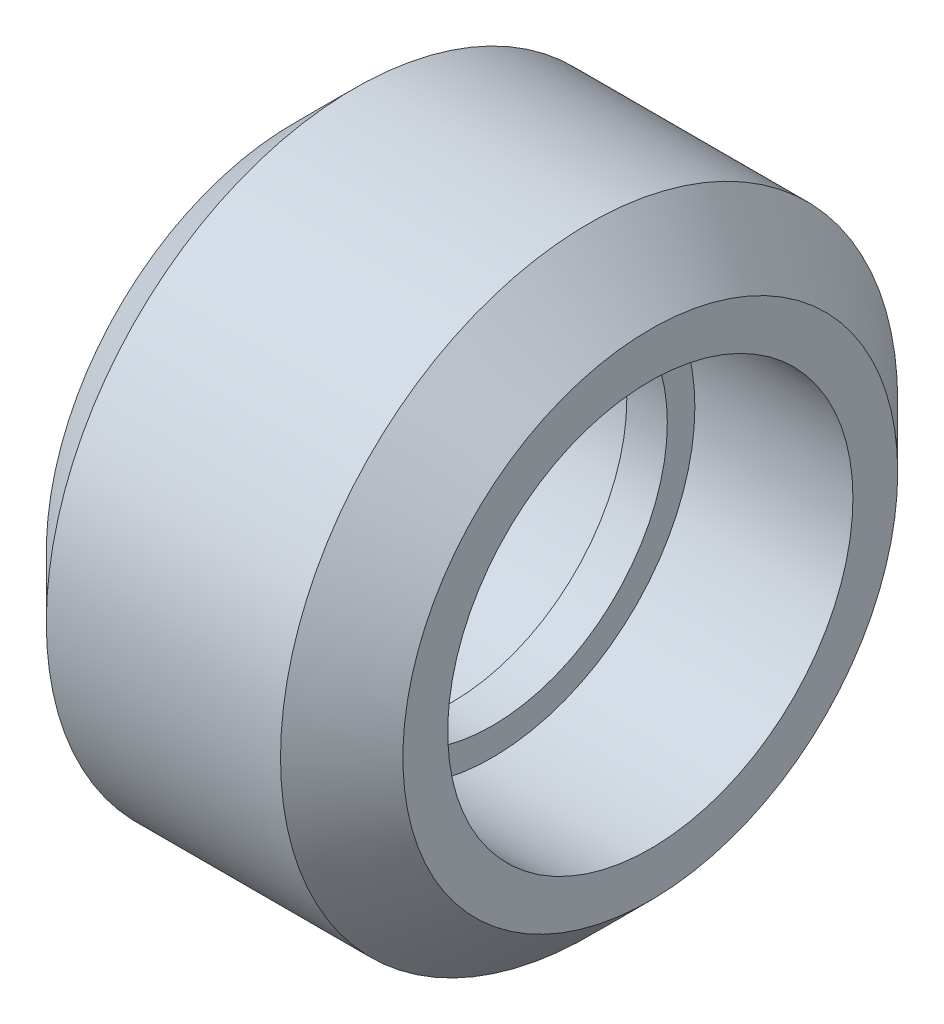
ISO-10303-21;
HEADER;
FILE_DESCRIPTION(('STEP AP214'),'2;1');
FILE_NAME('part.step','',(''),(''),'','','');
FILE_SCHEMA(('AUTOMOTIVE_DESIGN { 1 0 10303 214 1 1 1 1 }'));
ENDSEC;
DATA;
#1=APPLICATION_CONTEXT('core data for automotive mechanical design processes');
#2=APPLICATION_PROTOCOL_DEFINITION('international standard','automotive_design',2000,#1);
#3=PRODUCT_CONTEXT('',#1,'mechanical');
#4=PRODUCT('Part','Part','',(#3));
#5=PRODUCT_RELATED_PRODUCT_CATEGORY('part','',(#4));
#6=PRODUCT_DEFINITION_FORMATION('','',#4);
#7=PRODUCT_DEFINITION_CONTEXT('part definition',#1,'design');
#8=PRODUCT_DEFINITION('design','',#6,#7);
#9=PRODUCT_DEFINITION_SHAPE('','',#8);
#10=(LENGTH_UNIT() NAMED_UNIT(*) SI_UNIT(.MILLI.,.METRE.));
#11=(NAMED_UNIT(*) PLANE_ANGLE_UNIT() SI_UNIT($,.RADIAN.));
#12=(NAMED_UNIT(*) SI_UNIT($,.STERADIAN.) SOLID_ANGLE_UNIT());
#13=UNCERTAINTY_MEASURE_WITH_UNIT(LENGTH_MEASURE(1.E-05),#10,'distance_accuracy_value','');
#14=(GEOMETRIC_REPRESENTATION_CONTEXT(3) GLOBAL_UNCERTAINTY_ASSIGNED_CONTEXT((#13)) GLOBAL_UNIT_ASSIGNED_CONTEXT((#10,
#11,#12)) REPRESENTATION_CONTEXT('',''));
#15=CARTESIAN_POINT('',(0.,0.,0.));
#16=DIRECTION('',(0.,0.,1.));
#17=DIRECTION('',(1.,0.,0.));
#18=AXIS2_PLACEMENT_3D('',#15,#16,#17);
#19=CARTESIAN_POINT('',(-0.5,4.32,0.));
#20=DIRECTION('',(-1.,0.,0.));
#21=DIRECTION('',(0.,0.,1.));
#22=AXIS2_PLACEMENT_3D('',#19,#20,#21);
#23=PLANE('',#22);
#24=CARTESIAN_POINT('',(-0.5,0.,0.));
#25=DIRECTION('',(1.,0.,0.));
#26=DIRECTION('',(0.,0.,-1.));
#27=AXIS2_PLACEMENT_3D('',#24,#25,#26);
#28=CIRCLE('',#27,4.32);
#29=CARTESIAN_POINT('',(-0.5,0.,-4.32));
#30=VERTEX_POINT('',#29);
#31=EDGE_CURVE('E10',#30,#30,#28,.T.);
#32=ORIENTED_EDGE('',*,*,#31,.T.);
#33=EDGE_LOOP('',(#32));
#34=FACE_BOUND('',#33,.T.);
#35=CARTESIAN_POINT('',(-0.5,0.,0.));
#36=DIRECTION('',(1.,0.,0.));
#37=DIRECTION('',(0.,0.,-1.));
#38=AXIS2_PLACEMENT_3D('',#35,#36,#37);
#39=CIRCLE('',#38,5.);
#40=CARTESIAN_POINT('',(-0.5,0.,-5.));
#41=VERTEX_POINT('',#40);
#42=EDGE_CURVE('E73',#41,#41,#39,.T.);
#43=ORIENTED_EDGE('',*,*,#42,.F.);
#44=EDGE_LOOP('',(#43));
#45=FACE_BOUND('',#44,.T.);
#46=ADVANCED_FACE('F39',(#34,#45),#23,.T.);
#47=CARTESIAN_POINT('',(0.,0.,0.));
#48=DIRECTION('',(1.,0.,0.));
#49=DIRECTION('',(0.,0.,-1.));
#50=AXIS2_PLACEMENT_3D('',#47,#48,#49);
#51=CYLINDRICAL_SURFACE('',#50,4.32);
#52=CARTESIAN_POINT('',(0.5,0.,0.));
#53=DIRECTION('',(1.,0.,0.));
#54=DIRECTION('',(0.,0.,-1.));
#55=AXIS2_PLACEMENT_3D('',#52,#53,#54);
#56=CIRCLE('',#55,4.32);
#57=CARTESIAN_POINT('',(0.5,0.,-4.32));
#58=VERTEX_POINT('',#57);
#59=EDGE_CURVE('E45',#58,#58,#56,.T.);
#60=ORIENTED_EDGE('',*,*,#59,.T.);
#61=EDGE_LOOP('',(#60));
#62=FACE_BOUND('',#61,.T.);
#63=ORIENTED_EDGE('',*,*,#31,.F.);
#64=EDGE_LOOP('',(#63));
#65=FACE_BOUND('',#64,.T.);
#66=ADVANCED_FACE('F81',(#62,#65),#51,.F.);
#67=CARTESIAN_POINT('',(0.5,4.32,0.));
#68=DIRECTION('',(1.,0.,0.));
#69=DIRECTION('',(0.,0.,-1.));
#70=AXIS2_PLACEMENT_3D('',#67,#68,#69);
#71=PLANE('',#70);
#72=CARTESIAN_POINT('',(0.5,0.,0.));
#73=DIRECTION('',(1.,0.,0.));
#74=DIRECTION('',(0.,0.,-1.));
#75=AXIS2_PLACEMENT_3D('',#72,#73,#74);
#76=CIRCLE('',#75,5.);
#77=CARTESIAN_POINT('',(0.5,0.,-5.));
#78=VERTEX_POINT('',#77);
#79=EDGE_CURVE('E49',#78,#78,#76,.T.);
#80=ORIENTED_EDGE('',*,*,#79,.T.);
#81=EDGE_LOOP('',(#80));
#82=FACE_BOUND('',#81,.T.);
#83=ORIENTED_EDGE('',*,*,#59,.F.);
#84=EDGE_LOOP('',(#83));
#85=FACE_BOUND('',#84,.T.);
#86=ADVANCED_FACE('F85',(#82,#85),#71,.T.);
#87=CARTESIAN_POINT('',(0.,0.,0.));
#88=DIRECTION('',(1.,0.,0.));
#89=DIRECTION('',(0.,0.,-1.));
#90=AXIS2_PLACEMENT_3D('',#87,#88,#89);
#91=CYLINDRICAL_SURFACE('',#90,5.);
#92=CARTESIAN_POINT('',(4.4,0.,0.));
#93=DIRECTION('',(1.,0.,0.));
#94=DIRECTION('',(0.,0.,-1.));
#95=AXIS2_PLACEMENT_3D('',#92,#93,#94);
#96=CIRCLE('',#95,5.);
#97=CARTESIAN_POINT('',(4.4,0.,-5.));
#98=VERTEX_POINT('',#97);
#99=EDGE_CURVE('E53',#98,#98,#96,.T.);
#100=ORIENTED_EDGE('',*,*,#99,.T.);
#101=EDGE_LOOP('',(#100));
#102=FACE_BOUND('',#101,.T.);
#103=ORIENTED_EDGE('',*,*,#79,.F.);
#104=EDGE_LOOP('',(#103));
#105=FACE_BOUND('',#104,.T.);
#106=ADVANCED_FACE('F89',(#102,#105),#91,.F.);
#107=CARTESIAN_POINT('',(4.4,5.,0.));
#108=DIRECTION('',(1.,0.,0.));
#109=DIRECTION('',(0.,0.,-1.));
#110=AXIS2_PLACEMENT_3D('',#107,#108,#109);
#111=PLANE('',#110);
#112=CARTESIAN_POINT('',(4.4,0.,0.));
#113=DIRECTION('',(1.,0.,0.));
#114=DIRECTION('',(0.,0.,-1.));
#115=AXIS2_PLACEMENT_3D('',#112,#113,#114);
#116=CIRCLE('',#115,6.10500000000001);
#117=CARTESIAN_POINT('',(4.4,0.,-6.10500000000001));
#118=VERTEX_POINT('',#117);
#119=EDGE_CURVE('E58',#118,#118,#116,.T.);
#120=ORIENTED_EDGE('',*,*,#119,.T.);
#121=EDGE_LOOP('',(#120));
#122=FACE_BOUND('',#121,.T.);
#123=ORIENTED_EDGE('',*,*,#99,.F.);
#124=EDGE_LOOP('',(#123));
#125=FACE_BOUND('',#124,.T.);
#126=ADVANCED_FACE('F96',(#122,#125),#111,.T.);
#127=CARTESIAN_POINT('',(4.4,0.,0.));
#128=DIRECTION('',(-1.,0.,0.));
#129=DIRECTION('',(0.,0.,1.));
#130=AXIS2_PLACEMENT_3D('',#127,#128,#129);
#131=CONICAL_SURFACE('',#130,6.10500000000001,0.785398163397447);
#132=CARTESIAN_POINT('',(2.89,0.,0.));
#133=DIRECTION('',(1.,0.,0.));
#134=DIRECTION('',(0.,0.,-1.));
#135=AXIS2_PLACEMENT_3D('',#132,#133,#134);
#136=CIRCLE('',#135,7.615);
#137=CARTESIAN_POINT('',(2.89,0.,-7.615));
#138=VERTEX_POINT('',#137);
#139=EDGE_CURVE('E61',#138,#138,#136,.T.);
#140=ORIENTED_EDGE('',*,*,#139,.T.);
#141=EDGE_LOOP('',(#140));
#142=FACE_BOUND('',#141,.T.);
#143=ORIENTED_EDGE('',*,*,#119,.F.);
#144=EDGE_LOOP('',(#143));
#145=FACE_BOUND('',#144,.T.);
#146=ADVANCED_FACE('F100',(#142,#145),#131,.T.);
#147=CARTESIAN_POINT('',(0.,0.,0.));
#148=DIRECTION('',(1.,0.,0.));
#149=DIRECTION('',(0.,0.,-1.));
#150=AXIS2_PLACEMENT_3D('',#147,#148,#149);
#151=CYLINDRICAL_SURFACE('',#150,7.615);
#152=CARTESIAN_POINT('',(-2.89,0.,0.));
#153=DIRECTION('',(1.,0.,0.));
#154=DIRECTION('',(0.,0.,-1.));
#155=AXIS2_PLACEMENT_3D('',#152,#153,#154);
#156=CIRCLE('',#155,7.615);
#157=CARTESIAN_POINT('',(-2.89,0.,-7.615));
#158=VERTEX_POINT('',#157);
#159=EDGE_CURVE('E64',#158,#158,#156,.T.);
#160=ORIENTED_EDGE('',*,*,#159,.T.);
#161=EDGE_LOOP('',(#160));
#162=FACE_BOUND('',#161,.T.);
#163=ORIENTED_EDGE('',*,*,#139,.F.);
#164=EDGE_LOOP('',(#163));
#165=FACE_BOUND('',#164,.T.);
#166=ADVANCED_FACE('F104',(#162,#165),#151,.T.);
#167=CARTESIAN_POINT('',(-2.89,0.,0.));
#168=DIRECTION('',(1.,0.,0.));
#169=DIRECTION('',(0.,0.,-1.));
#170=AXIS2_PLACEMENT_3D('',#167,#168,#169);
#171=CONICAL_SURFACE('',#170,7.615,0.785398163397447);
#172=CARTESIAN_POINT('',(-4.4,0.,0.));
#173=DIRECTION('',(1.,0.,0.));
#174=DIRECTION('',(0.,0.,-1.));
#175=AXIS2_PLACEMENT_3D('',#172,#173,#174);
#176=CIRCLE('',#175,6.105);
#177=CARTESIAN_POINT('',(-4.4,0.,-6.105));
#178=VERTEX_POINT('',#177);
#179=EDGE_CURVE('E67',#178,#178,#176,.T.);
#180=ORIENTED_EDGE('',*,*,#179,.T.);
#181=EDGE_LOOP('',(#180));
#182=FACE_BOUND('',#181,.T.);
#183=ORIENTED_EDGE('',*,*,#159,.F.);
#184=EDGE_LOOP('',(#183));
#185=FACE_BOUND('',#184,.T.);
#186=ADVANCED_FACE('F108',(#182,#185),#171,.T.);
#187=CARTESIAN_POINT('',(-4.4,5.,0.));
#188=DIRECTION('',(-1.,0.,0.));
#189=DIRECTION('',(0.,0.,1.));
#190=AXIS2_PLACEMENT_3D('',#187,#188,#189);
#191=PLANE('',#190);
#192=CARTESIAN_POINT('',(-4.4,0.,0.));
#193=DIRECTION('',(1.,0.,0.));
#194=DIRECTION('',(0.,0.,-1.));
#195=AXIS2_PLACEMENT_3D('',#192,#193,#194);
#196=CIRCLE('',#195,5.);
#197=CARTESIAN_POINT('',(-4.4,0.,-5.));
#198=VERTEX_POINT('',#197);
#199=EDGE_CURVE('E70',#198,#198,#196,.T.);
#200=ORIENTED_EDGE('',*,*,#199,.T.);
#201=EDGE_LOOP('',(#200));
#202=FACE_BOUND('',#201,.T.);
#203=ORIENTED_EDGE('',*,*,#179,.F.);
#204=EDGE_LOOP('',(#203));
#205=FACE_BOUND('',#204,.T.);
#206=ADVANCED_FACE('F112',(#202,#205),#191,.T.);
#207=CARTESIAN_POINT('',(0.,0.,0.));
#208=DIRECTION('',(1.,0.,0.));
#209=DIRECTION('',(0.,0.,-1.));
#210=AXIS2_PLACEMENT_3D('',#207,#208,#209);
#211=CYLINDRICAL_SURFACE('',#210,5.);
#212=ORIENTED_EDGE('',*,*,#42,.T.);
#213=EDGE_LOOP('',(#212));
#214=FACE_BOUND('',#213,.T.);
#215=ORIENTED_EDGE('',*,*,#199,.F.);
#216=EDGE_LOOP('',(#215));
#217=FACE_BOUND('',#216,.T.);
#218=ADVANCED_FACE('F77',(#214,#217),#211,.F.);
#219=CLOSED_SHELL('',(#46,#66,#86,#106,#126,#146,#166,#186,#206,#218));
#220=MANIFOLD_SOLID_BREP('B2',#219);
#221=ADVANCED_BREP_SHAPE_REPRESENTATION('',(#18,#220),#14);
#222=SHAPE_DEFINITION_REPRESENTATION(#9,#221);
ENDSEC;
END-ISO-10303-21;
